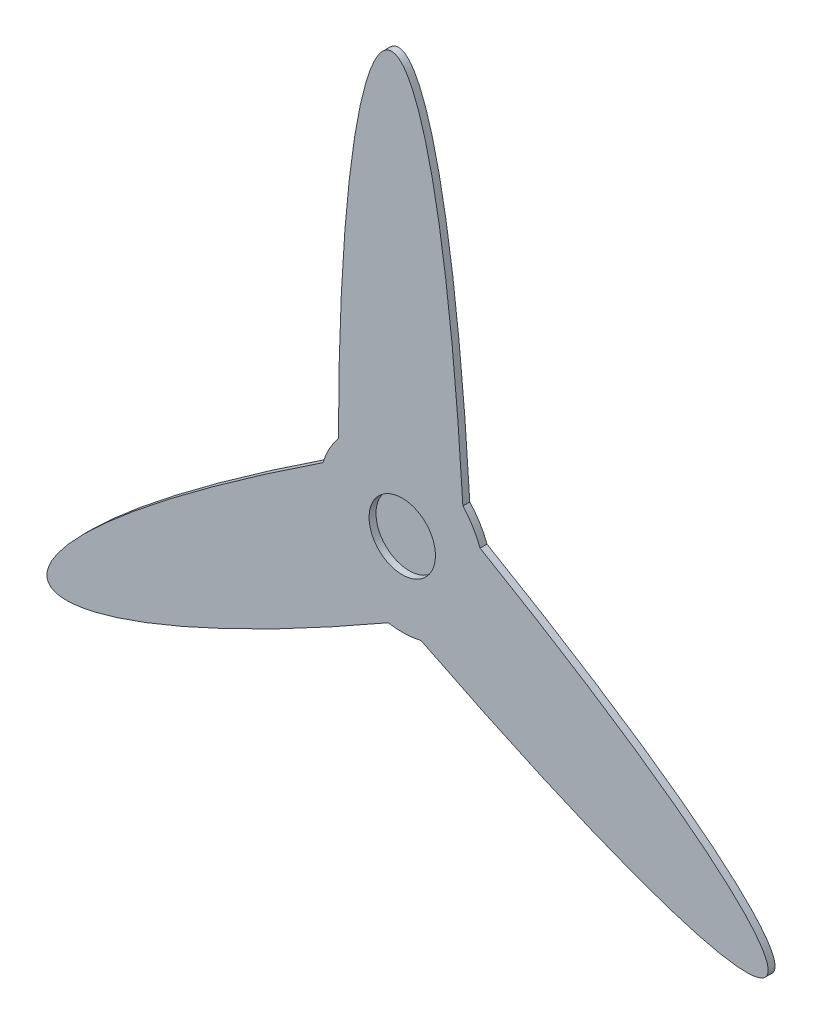
ISO-10303-21;
HEADER;
FILE_DESCRIPTION(('STEP AP214'),'2;1');
FILE_NAME('part.step','',(''),(''),'','','');
FILE_SCHEMA(('AUTOMOTIVE_DESIGN { 1 0 10303 214 1 1 1 1 }'));
ENDSEC;
DATA;
#1=APPLICATION_CONTEXT('core data for automotive mechanical design processes');
#2=APPLICATION_PROTOCOL_DEFINITION('international standard','automotive_design',2000,#1);
#3=PRODUCT_CONTEXT('',#1,'mechanical');
#4=PRODUCT('Part','Part','',(#3));
#5=PRODUCT_RELATED_PRODUCT_CATEGORY('part','',(#4));
#6=PRODUCT_DEFINITION_FORMATION('','',#4);
#7=PRODUCT_DEFINITION_CONTEXT('part definition',#1,'design');
#8=PRODUCT_DEFINITION('design','',#6,#7);
#9=PRODUCT_DEFINITION_SHAPE('','',#8);
#10=(LENGTH_UNIT() NAMED_UNIT(*) SI_UNIT(.MILLI.,.METRE.));
#11=(NAMED_UNIT(*) PLANE_ANGLE_UNIT() SI_UNIT($,.RADIAN.));
#12=(NAMED_UNIT(*) SI_UNIT($,.STERADIAN.) SOLID_ANGLE_UNIT());
#13=UNCERTAINTY_MEASURE_WITH_UNIT(LENGTH_MEASURE(1.E-05),#10,'distance_accuracy_value','');
#14=(GEOMETRIC_REPRESENTATION_CONTEXT(3) GLOBAL_UNCERTAINTY_ASSIGNED_CONTEXT((#13)) GLOBAL_UNIT_ASSIGNED_CONTEXT((#10,
#11,#12)) REPRESENTATION_CONTEXT('',''));
#15=CARTESIAN_POINT('',(0.,0.,0.));
#16=DIRECTION('',(0.,0.,1.));
#17=DIRECTION('',(1.,0.,0.));
#18=AXIS2_PLACEMENT_3D('',#15,#16,#17);
#19=CARTESIAN_POINT('',(0.,0.,5.));
#20=DIRECTION('',(0.,0.,-1.));
#21=DIRECTION('',(-1.,0.,0.));
#22=AXIS2_PLACEMENT_3D('',#19,#20,#21);
#23=CYLINDRICAL_SURFACE('',#22,60.);
#24=DIRECTION('',(0.,0.,-1.));
#25=VECTOR('',#24,1.);
#26=CARTESIAN_POINT('',(-57.3971839096201,17.4803683955815,5.));
#27=LINE('',#26,#25);
#28=CARTESIAN_POINT('',(-57.3971839096201,17.4803683955815,5.));
#29=VERTEX_POINT('',#28);
#30=CARTESIAN_POINT('',(-57.3971839096201,17.4803683955815,0.));
#31=VERTEX_POINT('',#30);
#32=EDGE_CURVE('E106',#29,#31,#27,.T.);
#33=ORIENTED_EDGE('',*,*,#32,.F.);
#34=CARTESIAN_POINT('',(0.,0.,5.));
#35=DIRECTION('',(0.,0.,1.));
#36=DIRECTION('',(1.,0.,0.));
#37=AXIS2_PLACEMENT_3D('',#34,#35,#36);
#38=CIRCLE('',#37,60.);
#39=CARTESIAN_POINT('',(-46.1629649471058,38.3272835887476,5.));
#40=VERTEX_POINT('',#39);
#41=EDGE_CURVE('E132',#40,#29,#38,.T.);
#42=ORIENTED_EDGE('',*,*,#41,.F.);
#43=DIRECTION('',(0.,0.,-1.));
#44=VECTOR('',#43,1.);
#45=CARTESIAN_POINT('',(-46.1629649471058,38.3272835887476,5.));
#46=LINE('',#45,#44);
#47=CARTESIAN_POINT('',(-46.1629649471058,38.3272835887476,0.));
#48=VERTEX_POINT('',#47);
#49=EDGE_CURVE('E11',#40,#48,#46,.T.);
#50=ORIENTED_EDGE('',*,*,#49,.T.);
#51=CARTESIAN_POINT('',(0.,0.,0.));
#52=DIRECTION('',(0.,0.,1.));
#53=DIRECTION('',(1.,0.,0.));
#54=AXIS2_PLACEMENT_3D('',#51,#52,#53);
#55=CIRCLE('',#54,60.);
#56=EDGE_CURVE('E97',#48,#31,#55,.T.);
#57=ORIENTED_EDGE('',*,*,#56,.T.);
#58=EDGE_LOOP('',(#33,#42,#50,#57));
#59=FACE_BOUND('',#58,.T.);
#60=ADVANCED_FACE('F37',(#59),#23,.T.);
#61=DIRECTION('',(0.,0.,-1.));
#62=VECTOR('',#61,1.);
#63=CARTESIAN_POINT('',(-10.1109187723526,-59.1419421525781,5.));
#64=LINE('',#63,#62);
#65=CARTESIAN_POINT('',(-10.1109187723526,-59.141942152578,5.));
#66=VERTEX_POINT('',#65);
#67=CARTESIAN_POINT('',(-10.1109187723526,-59.1419421525781,0.));
#68=VERTEX_POINT('',#67);
#69=EDGE_CURVE('E101',#66,#68,#64,.T.);
#70=ORIENTED_EDGE('',*,*,#69,.T.);
#71=CARTESIAN_POINT('',(13.5601488567261,-58.4476035692091,0.));
#72=VERTEX_POINT('',#71);
#73=EDGE_CURVE('E90',#68,#72,#55,.T.);
#74=ORIENTED_EDGE('',*,*,#73,.T.);
#75=DIRECTION('',(0.,0.,-1.));
#76=VECTOR('',#75,1.);
#77=CARTESIAN_POINT('',(13.5601488567261,-58.4476035692091,5.));
#78=LINE('',#77,#76);
#79=CARTESIAN_POINT('',(13.5601488567261,-58.4476035692091,5.));
#80=VERTEX_POINT('',#79);
#81=EDGE_CURVE('E53',#80,#72,#78,.T.);
#82=ORIENTED_EDGE('',*,*,#81,.F.);
#83=EDGE_CURVE('E57',#66,#80,#38,.T.);
#84=ORIENTED_EDGE('',*,*,#83,.F.);
#85=EDGE_LOOP('',(#70,#74,#82,#84));
#86=FACE_BOUND('',#85,.T.);
#87=ADVANCED_FACE('F102',(#86),#23,.T.);
#88=DIRECTION('',(0.,0.,-1.));
#89=VECTOR('',#88,1.);
#90=CARTESIAN_POINT('',(56.2738837194585,20.814658563831,5.));
#91=LINE('',#90,#89);
#92=CARTESIAN_POINT('',(56.2738837194585,20.814658563831,5.));
#93=VERTEX_POINT('',#92);
#94=CARTESIAN_POINT('',(56.2738837194585,20.814658563831,0.));
#95=VERTEX_POINT('',#94);
#96=EDGE_CURVE('E111',#93,#95,#91,.T.);
#97=ORIENTED_EDGE('',*,*,#96,.T.);
#98=CARTESIAN_POINT('',(43.8370350528945,40.9672351736275,0.));
#99=VERTEX_POINT('',#98);
#100=EDGE_CURVE('E98',#95,#99,#55,.T.);
#101=ORIENTED_EDGE('',*,*,#100,.T.);
#102=DIRECTION('',(0.,0.,-1.));
#103=VECTOR('',#102,1.);
#104=CARTESIAN_POINT('',(43.8370350528945,40.9672351736275,5.));
#105=LINE('',#104,#103);
#106=CARTESIAN_POINT('',(43.8370350528945,40.9672351736275,5.));
#107=VERTEX_POINT('',#106);
#108=EDGE_CURVE('E46',#107,#99,#105,.T.);
#109=ORIENTED_EDGE('',*,*,#108,.F.);
#110=EDGE_CURVE('E130',#93,#107,#38,.T.);
#111=ORIENTED_EDGE('',*,*,#110,.F.);
#112=EDGE_LOOP('',(#97,#101,#109,#111));
#113=FACE_BOUND('',#112,.T.);
#114=ADVANCED_FACE('F196',(#113),#23,.T.);
#115=CARTESIAN_POINT('',(43.8370350528945,40.9672351736275,5.));
#116=CARTESIAN_POINT('',(22.5733196660893,400.135667747044,5.));
#117=CARTESIAN_POINT('',(-45.6293244758778,373.080153995763,5.));
#118=CARTESIAN_POINT('',(-46.1629649471055,38.3272835887473,5.));
#119=B_SPLINE_CURVE_WITH_KNOTS('',3,(#115,#116,#117,#118),.UNSPECIFIED.,.F.,.F.,(4,4),(0.,1.),.UNSPECIFIED.);
#120=DIRECTION('',(0.,0.,-1.));
#121=VECTOR('',#120,1.);
#122=SURFACE_OF_LINEAR_EXTRUSION('',#119,#121);
#123=CARTESIAN_POINT('',(43.8370350528945,40.9672351736275,0.));
#124=CARTESIAN_POINT('',(22.5733196660893,400.135667747044,0.));
#125=CARTESIAN_POINT('',(-45.6293244758778,373.080153995763,0.));
#126=CARTESIAN_POINT('',(-46.1629649471055,38.3272835887473,0.));
#127=B_SPLINE_CURVE_WITH_KNOTS('',3,(#123,#124,#125,#126),.UNSPECIFIED.,.F.,.F.,(4,4),(0.,1.),.UNSPECIFIED.);
#128=EDGE_CURVE('E105',#99,#48,#127,.T.);
#129=ORIENTED_EDGE('',*,*,#128,.T.);
#130=ORIENTED_EDGE('',*,*,#49,.F.);
#131=EDGE_CURVE('E124',#107,#40,#119,.T.);
#132=ORIENTED_EDGE('',*,*,#131,.F.);
#133=ORIENTED_EDGE('',*,*,#108,.T.);
#134=EDGE_LOOP('',(#129,#130,#132,#133));
#135=FACE_BOUND('',#134,.T.);
#136=ADVANCED_FACE('F39',(#135),#122,.F.);
#137=CARTESIAN_POINT('',(0.,0.,5.));
#138=DIRECTION('',(0.,0.,-1.));
#139=DIRECTION('',(-1.,0.,0.));
#140=AXIS2_PLACEMENT_3D('',#137,#138,#139);
#141=CYLINDRICAL_SURFACE('',#140,24.);
#142=CARTESIAN_POINT('',(0.,0.,5.));
#143=DIRECTION('',(0.,0.,1.));
#144=DIRECTION('',(1.,0.,0.));
#145=AXIS2_PLACEMENT_3D('',#142,#143,#144);
#146=CIRCLE('',#145,24.);
#147=CARTESIAN_POINT('',(24.,0.,5.));
#148=VERTEX_POINT('',#147);
#149=EDGE_CURVE('E138',#148,#148,#146,.T.);
#150=ORIENTED_EDGE('',*,*,#149,.T.);
#151=EDGE_LOOP('',(#150));
#152=FACE_BOUND('',#151,.T.);
#153=CARTESIAN_POINT('',(0.,0.,0.));
#154=DIRECTION('',(0.,0.,1.));
#155=DIRECTION('',(1.,0.,0.));
#156=AXIS2_PLACEMENT_3D('',#153,#154,#155);
#157=CIRCLE('',#156,24.);
#158=CARTESIAN_POINT('',(24.,0.,0.));
#159=VERTEX_POINT('',#158);
#160=EDGE_CURVE('E131',#159,#159,#157,.T.);
#161=ORIENTED_EDGE('',*,*,#160,.F.);
#162=EDGE_LOOP('',(#161));
#163=FACE_BOUND('',#162,.T.);
#164=ADVANCED_FACE('F189',(#152,#163),#141,.F.);
#165=CARTESIAN_POINT('',(0.,0.,5.));
#166=DIRECTION('',(0.,0.,1.));
#167=DIRECTION('',(1.,0.,0.));
#168=AXIS2_PLACEMENT_3D('',#165,#166,#167);
#169=PLANE('',#168);
#170=ORIENTED_EDGE('',*,*,#110,.T.);
#171=ORIENTED_EDGE('',*,*,#131,.T.);
#172=ORIENTED_EDGE('',*,*,#41,.T.);
#173=CARTESIAN_POINT('',(-57.3971839096201,17.4803683955815,5.));
#174=CARTESIAN_POINT('',(-357.814313062234,-180.518765594944,5.));
#175=CARTESIAN_POINT('',(-300.282228770201,-226.056231151516,5.));
#176=CARTESIAN_POINT('',(-10.1109187723525,-59.1419421525777,5.));
#177=B_SPLINE_CURVE_WITH_KNOTS('',3,(#173,#174,#175,#176),.UNSPECIFIED.,.F.,.F.,(4,4),(0.,1.),.UNSPECIFIED.);
#178=EDGE_CURVE('E110',#29,#66,#177,.T.);
#179=ORIENTED_EDGE('',*,*,#178,.T.);
#180=ORIENTED_EDGE('',*,*,#83,.T.);
#181=CARTESIAN_POINT('',(13.5601488567261,-58.4476035692091,5.));
#182=CARTESIAN_POINT('',(335.240993396147,-219.616902152099,5.));
#183=CARTESIAN_POINT('',(345.911553246081,-147.023922844245,5.));
#184=CARTESIAN_POINT('',(56.2738837194582,20.8146585638308,5.));
#185=B_SPLINE_CURVE_WITH_KNOTS('',3,(#181,#182,#183,#184),.UNSPECIFIED.,.F.,.F.,(4,4),(0.,1.),.UNSPECIFIED.);
#186=EDGE_CURVE('E162',#80,#93,#185,.T.);
#187=ORIENTED_EDGE('',*,*,#186,.T.);
#188=EDGE_LOOP('',(#170,#171,#172,#179,#180,#187));
#189=FACE_BOUND('',#188,.T.);
#190=ORIENTED_EDGE('',*,*,#149,.F.);
#191=EDGE_LOOP('',(#190));
#192=FACE_BOUND('',#191,.T.);
#193=ADVANCED_FACE('F158',(#189,#192),#169,.T.);
#194=CARTESIAN_POINT('',(0.,0.,0.));
#195=DIRECTION('',(0.,0.,1.));
#196=DIRECTION('',(1.,0.,0.));
#197=AXIS2_PLACEMENT_3D('',#194,#195,#196);
#198=PLANE('',#197);
#199=CARTESIAN_POINT('',(0.,0.,0.));
#200=DIRECTION('',(0.,0.,-1.));
#201=DIRECTION('',(-1.,0.,0.));
#202=AXIS2_PLACEMENT_3D('',#199,#200,#201);
#203=CIRCLE('',#202,28.5);
#204=CARTESIAN_POINT('',(-28.5,0.,-1.99014436314059E-13));
#205=VERTEX_POINT('',#204);
#206=EDGE_CURVE('E168',#205,#205,#203,.T.);
#207=ORIENTED_EDGE('',*,*,#206,.F.);
#208=EDGE_LOOP('',(#207));
#209=FACE_BOUND('',#208,.T.);
#210=ORIENTED_EDGE('',*,*,#56,.F.);
#211=ORIENTED_EDGE('',*,*,#128,.F.);
#212=ORIENTED_EDGE('',*,*,#100,.F.);
#213=CARTESIAN_POINT('',(13.5601488567261,-58.4476035692091,0.));
#214=CARTESIAN_POINT('',(335.240993396147,-219.616902152099,0.));
#215=CARTESIAN_POINT('',(345.911553246081,-147.023922844245,0.));
#216=CARTESIAN_POINT('',(56.2738837194582,20.8146585638308,0.));
#217=B_SPLINE_CURVE_WITH_KNOTS('',3,(#213,#214,#215,#216),.UNSPECIFIED.,.F.,.F.,(4,4),(0.,1.),.UNSPECIFIED.);
#218=EDGE_CURVE('E96',#72,#95,#217,.T.);
#219=ORIENTED_EDGE('',*,*,#218,.F.);
#220=ORIENTED_EDGE('',*,*,#73,.F.);
#221=CARTESIAN_POINT('',(-57.3971839096201,17.4803683955815,0.));
#222=CARTESIAN_POINT('',(-357.814313062234,-180.518765594944,0.));
#223=CARTESIAN_POINT('',(-300.282228770201,-226.056231151516,0.));
#224=CARTESIAN_POINT('',(-10.1109187723525,-59.1419421525777,0.));
#225=B_SPLINE_CURVE_WITH_KNOTS('',3,(#221,#222,#223,#224),.UNSPECIFIED.,.F.,.F.,(4,4),(0.,1.),.UNSPECIFIED.);
#226=EDGE_CURVE('E93',#31,#68,#225,.T.);
#227=ORIENTED_EDGE('',*,*,#226,.F.);
#228=EDGE_LOOP('',(#210,#211,#212,#219,#220,#227));
#229=FACE_BOUND('',#228,.T.);
#230=ADVANCED_FACE('F91',(#209,#229),#198,.F.);
#231=DIRECTION('',(0.,0.,-1.));
#232=VECTOR('',#231,1.);
#233=SURFACE_OF_LINEAR_EXTRUSION('',#185,#232);
#234=ORIENTED_EDGE('',*,*,#218,.T.);
#235=ORIENTED_EDGE('',*,*,#96,.F.);
#236=ORIENTED_EDGE('',*,*,#186,.F.);
#237=ORIENTED_EDGE('',*,*,#81,.T.);
#238=EDGE_LOOP('',(#234,#235,#236,#237));
#239=FACE_BOUND('',#238,.T.);
#240=ADVANCED_FACE('F165',(#239),#233,.F.);
#241=DIRECTION('',(0.,0.,-1.));
#242=VECTOR('',#241,1.);
#243=SURFACE_OF_LINEAR_EXTRUSION('',#177,#242);
#244=ORIENTED_EDGE('',*,*,#226,.T.);
#245=ORIENTED_EDGE('',*,*,#69,.F.);
#246=ORIENTED_EDGE('',*,*,#178,.F.);
#247=ORIENTED_EDGE('',*,*,#32,.T.);
#248=EDGE_LOOP('',(#244,#245,#246,#247));
#249=FACE_BOUND('',#248,.T.);
#250=ADVANCED_FACE('F109',(#249),#243,.F.);
#251=CARTESIAN_POINT('',(0.,0.,0.));
#252=DIRECTION('',(0.,1.,0.));
#253=DIRECTION('',(-1.,0.,0.));
#254=AXIS2_PLACEMENT_3D('',#251,#252,#253);
#255=SPHERICAL_SURFACE('',#254,28.5);
#256=CARTESIAN_POINT('',(0.,0.,0.));
#257=DIRECTION('',(0.,0.,-1.));
#258=DIRECTION('',(-1.,0.,0.));
#259=AXIS2_PLACEMENT_3D('',#256,#257,#258);
#260=SPHERICAL_SURFACE('',#259,28.5);
#261=ORIENTED_EDGE('',*,*,#206,.T.);
#262=EDGE_LOOP('',(#261));
#263=FACE_BOUND('',#262,.T.);
#264=ADVANCED_FACE('F183',(#263),#260,.T.);
#265=CARTESIAN_POINT('',(0.,0.,0.));
#266=DIRECTION('',(0.,0.,-1.));
#267=DIRECTION('',(-1.,0.,0.));
#268=AXIS2_PLACEMENT_3D('',#265,#266,#267);
#269=PLANE('',#268);
#270=ORIENTED_EDGE('',*,*,#160,.T.);
#271=EDGE_LOOP('',(#270));
#272=FACE_BOUND('',#271,.T.);
#273=ADVANCED_FACE('F232',(#272),#269,.F.);
#274=CLOSED_SHELL('',(#60,#87,#114,#136,#164,#193,#230,#240,#250,#264,#273));
#275=MANIFOLD_SOLID_BREP('B2',#274);
#276=ADVANCED_BREP_SHAPE_REPRESENTATION('',(#18,#275),#14);
#277=SHAPE_DEFINITION_REPRESENTATION(#9,#276);
ENDSEC;
END-ISO-10303-21;
